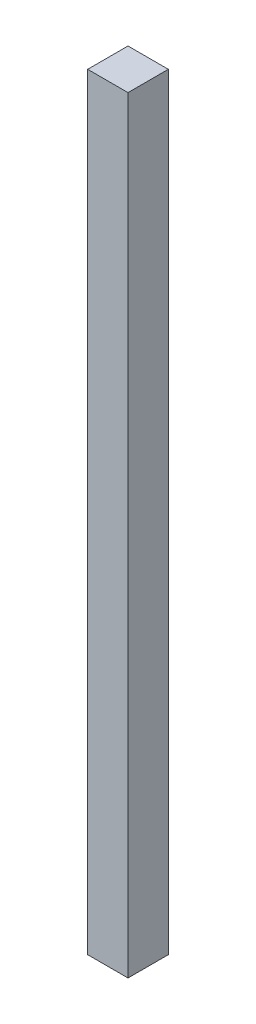
ISO-10303-21;
HEADER;
FILE_DESCRIPTION(('STEP AP214'),'2;1');
FILE_NAME('part.step','',(''),(''),'','','');
FILE_SCHEMA(('AUTOMOTIVE_DESIGN { 1 0 10303 214 1 1 1 1 }'));
ENDSEC;
DATA;
#1=APPLICATION_CONTEXT('core data for automotive mechanical design processes');
#2=APPLICATION_PROTOCOL_DEFINITION('international standard','automotive_design',2000,#1);
#3=PRODUCT_CONTEXT('',#1,'mechanical');
#4=PRODUCT('Part','Part','',(#3));
#5=PRODUCT_RELATED_PRODUCT_CATEGORY('part','',(#4));
#6=PRODUCT_DEFINITION_FORMATION('','',#4);
#7=PRODUCT_DEFINITION_CONTEXT('part definition',#1,'design');
#8=PRODUCT_DEFINITION('design','',#6,#7);
#9=PRODUCT_DEFINITION_SHAPE('','',#8);
#10=(LENGTH_UNIT() NAMED_UNIT(*) SI_UNIT(.MILLI.,.METRE.));
#11=(NAMED_UNIT(*) PLANE_ANGLE_UNIT() SI_UNIT($,.RADIAN.));
#12=(NAMED_UNIT(*) SI_UNIT($,.STERADIAN.) SOLID_ANGLE_UNIT());
#13=UNCERTAINTY_MEASURE_WITH_UNIT(LENGTH_MEASURE(1.E-05),#10,'distance_accuracy_value','');
#14=(GEOMETRIC_REPRESENTATION_CONTEXT(3) GLOBAL_UNCERTAINTY_ASSIGNED_CONTEXT((#13)) GLOBAL_UNIT_ASSIGNED_CONTEXT((#10,
#11,#12)) REPRESENTATION_CONTEXT('',''));
#15=CARTESIAN_POINT('',(0.,0.,0.));
#16=DIRECTION('',(0.,0.,1.));
#17=DIRECTION('',(1.,0.,0.));
#18=AXIS2_PLACEMENT_3D('',#15,#16,#17);
#19=CARTESIAN_POINT('',(0.,482.854,0.));
#20=DIRECTION('',(1.,0.,0.));
#21=DIRECTION('',(0.,0.,-1.));
#22=AXIS2_PLACEMENT_3D('',#19,#20,#21);
#23=PLANE('',#22);
#24=DIRECTION('',(0.,0.,1.));
#25=VECTOR('',#24,1.);
#26=CARTESIAN_POINT('',(0.,0.,0.));
#27=LINE('',#26,#25);
#28=CARTESIAN_POINT('',(0.,-4.44089209850063E-13,-25.4000000000003));
#29=VERTEX_POINT('',#28);
#30=CARTESIAN_POINT('',(0.,0.,0.));
#31=VERTEX_POINT('',#30);
#32=EDGE_CURVE('E97',#29,#31,#27,.T.);
#33=ORIENTED_EDGE('',*,*,#32,.T.);
#34=DIRECTION('',(0.,-1.,0.));
#35=VECTOR('',#34,1.);
#36=CARTESIAN_POINT('',(0.,482.854,0.));
#37=LINE('',#36,#35);
#38=CARTESIAN_POINT('',(0.,482.854,0.));
#39=VERTEX_POINT('',#38);
#40=EDGE_CURVE('E11',#39,#31,#37,.T.);
#41=ORIENTED_EDGE('',*,*,#40,.F.);
#42=DIRECTION('',(0.,0.,1.));
#43=VECTOR('',#42,1.);
#44=CARTESIAN_POINT('',(0.,482.854,0.));
#45=LINE('',#44,#43);
#46=CARTESIAN_POINT('',(0.,482.854000000001,-25.4000000000005));
#47=VERTEX_POINT('',#46);
#48=EDGE_CURVE('E85',#47,#39,#45,.T.);
#49=ORIENTED_EDGE('',*,*,#48,.F.);
#50=DIRECTION('',(0.,-1.,0.));
#51=VECTOR('',#50,1.);
#52=CARTESIAN_POINT('',(0.,482.854000000001,-25.4000000000005));
#53=LINE('',#52,#51);
#54=EDGE_CURVE('E93',#47,#29,#53,.T.);
#55=ORIENTED_EDGE('',*,*,#54,.T.);
#56=EDGE_LOOP('',(#33,#41,#49,#55));
#57=FACE_BOUND('',#56,.T.);
#58=ADVANCED_FACE('F34',(#57),#23,.F.);
#59=CARTESIAN_POINT('',(0.,482.854,0.));
#60=DIRECTION('',(0.,0.,-1.));
#61=DIRECTION('',(-1.,0.,0.));
#62=AXIS2_PLACEMENT_3D('',#59,#60,#61);
#63=PLANE('',#62);
#64=DIRECTION('',(1.,0.,0.));
#65=VECTOR('',#64,1.);
#66=CARTESIAN_POINT('',(0.,0.,0.));
#67=LINE('',#66,#65);
#68=CARTESIAN_POINT('',(25.4000000000001,0.,0.));
#69=VERTEX_POINT('',#68);
#70=EDGE_CURVE('E89',#31,#69,#67,.T.);
#71=ORIENTED_EDGE('',*,*,#70,.T.);
#72=DIRECTION('',(0.,-1.,0.));
#73=VECTOR('',#72,1.);
#74=CARTESIAN_POINT('',(25.4000000000001,482.854,0.));
#75=LINE('',#74,#73);
#76=CARTESIAN_POINT('',(25.4000000000001,482.854,0.));
#77=VERTEX_POINT('',#76);
#78=EDGE_CURVE('E42',#77,#69,#75,.T.);
#79=ORIENTED_EDGE('',*,*,#78,.F.);
#80=DIRECTION('',(1.,0.,0.));
#81=VECTOR('',#80,1.);
#82=CARTESIAN_POINT('',(0.,482.854,0.));
#83=LINE('',#82,#81);
#84=EDGE_CURVE('E80',#39,#77,#83,.T.);
#85=ORIENTED_EDGE('',*,*,#84,.F.);
#86=ORIENTED_EDGE('',*,*,#40,.T.);
#87=EDGE_LOOP('',(#71,#79,#85,#86));
#88=FACE_BOUND('',#87,.T.);
#89=ADVANCED_FACE('F88',(#88),#63,.F.);
#90=CARTESIAN_POINT('',(25.4000000000001,482.854,0.));
#91=DIRECTION('',(-1.,0.,0.));
#92=DIRECTION('',(0.,0.,1.));
#93=AXIS2_PLACEMENT_3D('',#90,#91,#92);
#94=PLANE('',#93);
#95=DIRECTION('',(0.,0.,-1.));
#96=VECTOR('',#95,1.);
#97=CARTESIAN_POINT('',(25.4000000000001,0.,0.));
#98=LINE('',#97,#96);
#99=CARTESIAN_POINT('',(25.4000000000001,-4.44089209850063E-13,-25.4000000000003));
#100=VERTEX_POINT('',#99);
#101=EDGE_CURVE('E67',#69,#100,#98,.T.);
#102=ORIENTED_EDGE('',*,*,#101,.T.);
#103=DIRECTION('',(0.,-1.,0.));
#104=VECTOR('',#103,1.);
#105=CARTESIAN_POINT('',(25.4000000000001,482.854000000001,-25.4000000000005));
#106=LINE('',#105,#104);
#107=CARTESIAN_POINT('',(25.4000000000001,482.854000000001,-25.4000000000005));
#108=VERTEX_POINT('',#107);
#109=EDGE_CURVE('E90',#108,#100,#106,.T.);
#110=ORIENTED_EDGE('',*,*,#109,.F.);
#111=DIRECTION('',(0.,0.,-1.));
#112=VECTOR('',#111,1.);
#113=CARTESIAN_POINT('',(25.4000000000001,482.854,0.));
#114=LINE('',#113,#112);
#115=EDGE_CURVE('E83',#77,#108,#114,.T.);
#116=ORIENTED_EDGE('',*,*,#115,.F.);
#117=ORIENTED_EDGE('',*,*,#78,.T.);
#118=EDGE_LOOP('',(#102,#110,#116,#117));
#119=FACE_BOUND('',#118,.T.);
#120=ADVANCED_FACE('F91',(#119),#94,.F.);
#121=CARTESIAN_POINT('',(0.,482.854000000001,-25.4000000000005));
#122=DIRECTION('',(0.,0.,1.));
#123=DIRECTION('',(1.,0.,0.));
#124=AXIS2_PLACEMENT_3D('',#121,#122,#123);
#125=PLANE('',#124);
#126=DIRECTION('',(-1.,0.,0.));
#127=VECTOR('',#126,1.);
#128=CARTESIAN_POINT('',(0.,-4.44089209850063E-13,-25.4000000000003));
#129=LINE('',#128,#127);
#130=EDGE_CURVE('E73',#100,#29,#129,.T.);
#131=ORIENTED_EDGE('',*,*,#130,.T.);
#132=ORIENTED_EDGE('',*,*,#54,.F.);
#133=DIRECTION('',(-1.,0.,0.));
#134=VECTOR('',#133,1.);
#135=CARTESIAN_POINT('',(0.,482.854000000001,-25.4000000000005));
#136=LINE('',#135,#134);
#137=EDGE_CURVE('E50',#108,#47,#136,.T.);
#138=ORIENTED_EDGE('',*,*,#137,.F.);
#139=ORIENTED_EDGE('',*,*,#109,.T.);
#140=EDGE_LOOP('',(#131,#132,#138,#139));
#141=FACE_BOUND('',#140,.T.);
#142=ADVANCED_FACE('F104',(#141),#125,.F.);
#143=CARTESIAN_POINT('',(0.,482.854,0.));
#144=DIRECTION('',(0.,-1.,0.));
#145=DIRECTION('',(0.,0.,-1.));
#146=AXIS2_PLACEMENT_3D('',#143,#144,#145);
#147=PLANE('',#146);
#148=ORIENTED_EDGE('',*,*,#48,.T.);
#149=ORIENTED_EDGE('',*,*,#84,.T.);
#150=ORIENTED_EDGE('',*,*,#115,.T.);
#151=ORIENTED_EDGE('',*,*,#137,.T.);
#152=EDGE_LOOP('',(#148,#149,#150,#151));
#153=FACE_BOUND('',#152,.T.);
#154=ADVANCED_FACE('F81',(#153),#147,.F.);
#155=CARTESIAN_POINT('',(0.,0.,0.));
#156=DIRECTION('',(0.,-1.,0.));
#157=DIRECTION('',(0.,0.,-1.));
#158=AXIS2_PLACEMENT_3D('',#155,#156,#157);
#159=PLANE('',#158);
#160=ORIENTED_EDGE('',*,*,#32,.F.);
#161=ORIENTED_EDGE('',*,*,#130,.F.);
#162=ORIENTED_EDGE('',*,*,#101,.F.);
#163=ORIENTED_EDGE('',*,*,#70,.F.);
#164=EDGE_LOOP('',(#160,#161,#162,#163));
#165=FACE_BOUND('',#164,.T.);
#166=ADVANCED_FACE('F107',(#165),#159,.T.);
#167=CLOSED_SHELL('',(#58,#89,#120,#142,#154,#166));
#168=MANIFOLD_SOLID_BREP('B2',#167);
#169=ADVANCED_BREP_SHAPE_REPRESENTATION('',(#18,#168),#14);
#170=SHAPE_DEFINITION_REPRESENTATION(#9,#169);
ENDSEC;
END-ISO-10303-21;
